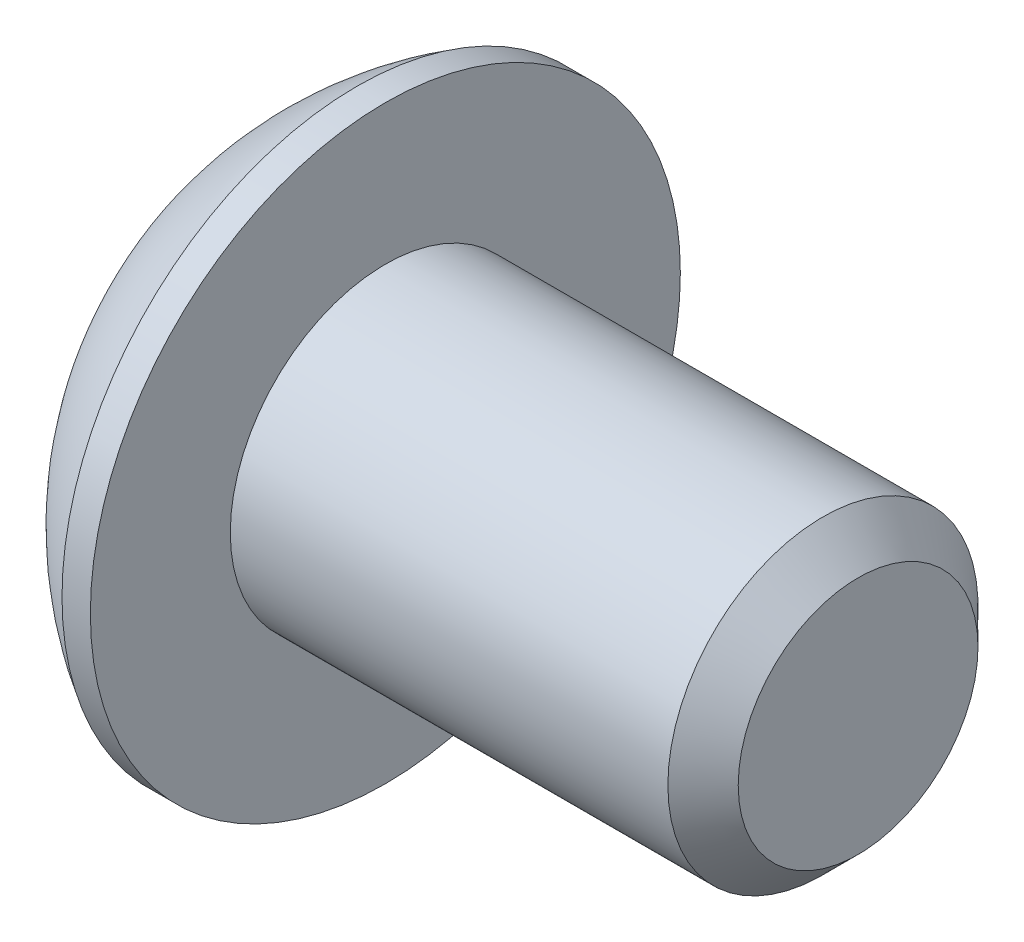
ISO-10303-21;
HEADER;
FILE_DESCRIPTION(('STEP AP214'),'2;1');
FILE_NAME('part.step','',(''),(''),'','','');
FILE_SCHEMA(('AUTOMOTIVE_DESIGN { 1 0 10303 214 1 1 1 1 }'));
ENDSEC;
DATA;
#1=APPLICATION_CONTEXT('core data for automotive mechanical design processes');
#2=APPLICATION_PROTOCOL_DEFINITION('international standard','automotive_design',2000,#1);
#3=PRODUCT_CONTEXT('',#1,'mechanical');
#4=PRODUCT('Part','Part','',(#3));
#5=PRODUCT_RELATED_PRODUCT_CATEGORY('part','',(#4));
#6=PRODUCT_DEFINITION_FORMATION('','',#4);
#7=PRODUCT_DEFINITION_CONTEXT('part definition',#1,'design');
#8=PRODUCT_DEFINITION('design','',#6,#7);
#9=PRODUCT_DEFINITION_SHAPE('','',#8);
#10=(LENGTH_UNIT() NAMED_UNIT(*) SI_UNIT(.MILLI.,.METRE.));
#11=(NAMED_UNIT(*) PLANE_ANGLE_UNIT() SI_UNIT($,.RADIAN.));
#12=(NAMED_UNIT(*) SI_UNIT($,.STERADIAN.) SOLID_ANGLE_UNIT());
#13=UNCERTAINTY_MEASURE_WITH_UNIT(LENGTH_MEASURE(1.E-05),#10,'distance_accuracy_value','');
#14=(GEOMETRIC_REPRESENTATION_CONTEXT(3) GLOBAL_UNCERTAINTY_ASSIGNED_CONTEXT((#13)) GLOBAL_UNIT_ASSIGNED_CONTEXT((#10,
#11,#12)) REPRESENTATION_CONTEXT('',''));
#15=CARTESIAN_POINT('',(0.,0.,0.));
#16=DIRECTION('',(0.,0.,1.));
#17=DIRECTION('',(1.,0.,0.));
#18=AXIS2_PLACEMENT_3D('',#15,#16,#17);
#19=CARTESIAN_POINT('',(8.55980000000001,0.,0.));
#20=DIRECTION('',(-1.,0.,0.));
#21=DIRECTION('',(0.,0.,1.));
#22=AXIS2_PLACEMENT_3D('',#19,#20,#21);
#23=PLANE('',#22);
#24=CARTESIAN_POINT('',(8.55979999994361,0.,0.));
#25=DIRECTION('',(-1.,0.,0.));
#26=DIRECTION('',(0.,0.,1.));
#27=AXIS2_PLACEMENT_3D('',#24,#25,#26);
#28=CIRCLE('',#27,1.61036000008604);
#29=CARTESIAN_POINT('',(8.55979999994361,0.,1.61036000008608));
#30=VERTEX_POINT('',#29);
#31=EDGE_CURVE('E21',#30,#30,#28,.T.);
#32=ORIENTED_EDGE('',*,*,#31,.F.);
#33=EDGE_LOOP('',(#32));
#34=FACE_BOUND('',#33,.T.);
#35=ADVANCED_FACE('F17',(#34),#23,.F.);
#36=CARTESIAN_POINT('',(8.08735999999044,0.,0.));
#37=DIRECTION('',(-1.,0.,0.));
#38=DIRECTION('',(0.,0.,1.));
#39=AXIS2_PLACEMENT_3D('',#36,#37,#38);
#40=CONICAL_SURFACE('',#39,2.08280000003921,0.785398163397448);
#41=ORIENTED_EDGE('',*,*,#31,.T.);
#42=EDGE_LOOP('',(#41));
#43=FACE_BOUND('',#42,.T.);
#44=CARTESIAN_POINT('',(8.08735999999999,0.,0.));
#45=DIRECTION('',(-1.,0.,0.));
#46=DIRECTION('',(0.,0.,1.));
#47=AXIS2_PLACEMENT_3D('',#44,#45,#46);
#48=CIRCLE('',#47,2.08280000000002);
#49=CARTESIAN_POINT('',(8.08735999999999,0.,2.08280000000002));
#50=VERTEX_POINT('',#49);
#51=EDGE_CURVE('E109',#50,#50,#48,.T.);
#52=ORIENTED_EDGE('',*,*,#51,.F.);
#53=EDGE_LOOP('',(#52));
#54=FACE_BOUND('',#53,.T.);
#55=ADVANCED_FACE('F311',(#43,#54),#40,.T.);
#56=CARTESIAN_POINT('',(1.32079999991674,0.,0.));
#57=DIRECTION('',(-1.,0.,0.));
#58=DIRECTION('',(0.,0.,1.));
#59=AXIS2_PLACEMENT_3D('',#56,#57,#58);
#60=CONICAL_SURFACE('',#59,1.19380000000998,1.04719755121067);
#61=CARTESIAN_POINT('',(2.01004075125866,0.,0.));
#62=VERTEX_POINT('',#61);
#63=VERTEX_LOOP('',#62);
#64=FACE_BOUND('',#63,.T.);
#65=CARTESIAN_POINT('',(1.32079999991674,0.,0.));
#66=DIRECTION('',(-1.,0.,0.));
#67=DIRECTION('',(0.,0.,1.));
#68=AXIS2_PLACEMENT_3D('',#65,#66,#67);
#69=CIRCLE('',#68,1.19380000000998);
#70=CARTESIAN_POINT('',(1.32079999995841,-1.03386112704217,0.596900000002525));
#71=VERTEX_POINT('',#70);
#72=CARTESIAN_POINT('',(1.32079999995191,0.,1.19379999997911));
#73=VERTEX_POINT('',#72);
#74=EDGE_CURVE('E94',#71,#73,#69,.T.);
#75=ORIENTED_EDGE('',*,*,#74,.T.);
#76=CARTESIAN_POINT('',(1.32079999991674,0.,0.));
#77=DIRECTION('',(-1.,0.,0.));
#78=DIRECTION('',(0.,0.,1.));
#79=AXIS2_PLACEMENT_3D('',#76,#77,#78);
#80=CIRCLE('',#79,1.19380000000998);
#81=CARTESIAN_POINT('',(1.32079999995841,1.03386112704219,0.596900000002536));
#82=VERTEX_POINT('',#81);
#83=EDGE_CURVE('E88',#73,#82,#80,.T.);
#84=ORIENTED_EDGE('',*,*,#83,.T.);
#85=CARTESIAN_POINT('',(1.32079999991674,0.,0.));
#86=DIRECTION('',(-1.,0.,0.));
#87=DIRECTION('',(0.,0.,1.));
#88=AXIS2_PLACEMENT_3D('',#85,#86,#87);
#89=CIRCLE('',#88,1.19380000000998);
#90=CARTESIAN_POINT('',(1.3207999999586,1.03386112704219,-0.596900000002484));
#91=VERTEX_POINT('',#90);
#92=EDGE_CURVE('E91',#82,#91,#89,.T.);
#93=ORIENTED_EDGE('',*,*,#92,.T.);
#94=CARTESIAN_POINT('',(1.32079999991674,0.,0.));
#95=DIRECTION('',(-1.,0.,0.));
#96=DIRECTION('',(0.,0.,1.));
#97=AXIS2_PLACEMENT_3D('',#94,#95,#96);
#98=CIRCLE('',#97,1.19380000000998);
#99=CARTESIAN_POINT('',(1.32079999995838,1.49000099134676E-12,-1.19380000000498));
#100=VERTEX_POINT('',#99);
#101=EDGE_CURVE('E153',#91,#100,#98,.T.);
#102=ORIENTED_EDGE('',*,*,#101,.T.);
#103=CARTESIAN_POINT('',(1.32079999991674,0.,0.));
#104=DIRECTION('',(-1.,0.,0.));
#105=DIRECTION('',(0.,0.,1.));
#106=AXIS2_PLACEMENT_3D('',#103,#104,#105);
#107=CIRCLE('',#106,1.19380000000998);
#108=CARTESIAN_POINT('',(1.3207999999586,-1.03386112704217,-0.596900000002466));
#109=VERTEX_POINT('',#108);
#110=EDGE_CURVE('E155',#100,#109,#107,.T.);
#111=ORIENTED_EDGE('',*,*,#110,.T.);
#112=CARTESIAN_POINT('',(1.32079999991674,0.,0.));
#113=DIRECTION('',(-1.,0.,0.));
#114=DIRECTION('',(0.,0.,1.));
#115=AXIS2_PLACEMENT_3D('',#112,#113,#114);
#116=CIRCLE('',#115,1.19380000000998);
#117=EDGE_CURVE('E157',#109,#71,#116,.T.);
#118=ORIENTED_EDGE('',*,*,#117,.T.);
#119=EDGE_LOOP('',(#75,#84,#93,#102,#111,#118));
#120=FACE_BOUND('',#119,.T.);
#121=ADVANCED_FACE('F90',(#64,#120),#60,.F.);
#122=CARTESIAN_POINT('',(0.,0.,0.));
#123=DIRECTION('',(-1.,0.,0.));
#124=DIRECTION('',(0.,0.,1.));
#125=AXIS2_PLACEMENT_3D('',#122,#123,#124);
#126=CYLINDRICAL_SURFACE('',#125,2.08280000000002);
#127=ORIENTED_EDGE('',*,*,#51,.T.);
#128=EDGE_LOOP('',(#127));
#129=FACE_BOUND('',#128,.T.);
#130=CARTESIAN_POINT('',(2.20979999999998,0.,0.));
#131=DIRECTION('',(-1.,0.,0.));
#132=DIRECTION('',(0.,0.,1.));
#133=AXIS2_PLACEMENT_3D('',#130,#131,#132);
#134=CIRCLE('',#133,2.08280000000002);
#135=CARTESIAN_POINT('',(2.20979999999998,0.,2.08280000000002));
#136=VERTEX_POINT('',#135);
#137=EDGE_CURVE('E150',#136,#136,#134,.F.);
#138=ORIENTED_EDGE('',*,*,#137,.T.);
#139=EDGE_LOOP('',(#138));
#140=FACE_BOUND('',#139,.T.);
#141=ADVANCED_FACE('F302',(#129,#140),#126,.T.);
#142=CARTESIAN_POINT('',(1.32080000000001,-2.06772225407572,-1.19379999999998));
#143=DIRECTION('',(1.,0.,0.));
#144=DIRECTION('',(0.,0.,-1.));
#145=AXIS2_PLACEMENT_3D('',#142,#143,#144);
#146=PLANE('',#145);
#147=DIRECTION('',(0.,-0.5,-0.866025403784439));
#148=VECTOR('',#147,1.);
#149=CARTESIAN_POINT('',(1.32080000000045,1.37848150271718,0.));
#150=LINE('',#149,#148);
#151=CARTESIAN_POINT('',(1.32080000000016,1.37848150271718,0.));
#152=VERTEX_POINT('',#151);
#153=EDGE_CURVE('E107',#91,#152,#150,.F.);
#154=ORIENTED_EDGE('',*,*,#153,.F.);
#155=ORIENTED_EDGE('',*,*,#92,.F.);
#156=DIRECTION('',(0.,0.5,-0.866025403784438));
#157=VECTOR('',#156,1.);
#158=CARTESIAN_POINT('',(1.32080000000001,0.68924075135858,1.19380000000002));
#159=LINE('',#158,#157);
#160=EDGE_CURVE('E105',#152,#82,#159,.F.);
#161=ORIENTED_EDGE('',*,*,#160,.F.);
#162=EDGE_LOOP('',(#154,#155,#161));
#163=FACE_BOUND('',#162,.T.);
#164=ADVANCED_FACE('F103',(#163),#146,.F.);
#165=CARTESIAN_POINT('',(1.32080000000001,-2.06772225407572,-1.19379999999998));
#166=DIRECTION('',(1.,0.,0.));
#167=DIRECTION('',(0.,0.,-1.));
#168=AXIS2_PLACEMENT_3D('',#165,#166,#167);
#169=PLANE('',#168);
#170=DIRECTION('',(0.,0.5,-0.866025403784438));
#171=VECTOR('',#170,1.);
#172=CARTESIAN_POINT('',(1.32080000000007,0.68924075135858,1.19380000000002));
#173=LINE('',#172,#171);
#174=CARTESIAN_POINT('',(1.32080000000028,0.6892407513586,1.19380000000003));
#175=VERTEX_POINT('',#174);
#176=EDGE_CURVE('E110',#82,#175,#173,.F.);
#177=ORIENTED_EDGE('',*,*,#176,.F.);
#178=ORIENTED_EDGE('',*,*,#83,.F.);
#179=DIRECTION('',(0.,1.,0.));
#180=VECTOR('',#179,1.);
#181=CARTESIAN_POINT('',(1.32080000000051,-0.689240751358577,1.19380000000003));
#182=LINE('',#181,#180);
#183=EDGE_CURVE('E113',#175,#73,#182,.F.);
#184=ORIENTED_EDGE('',*,*,#183,.F.);
#185=EDGE_LOOP('',(#177,#178,#184));
#186=FACE_BOUND('',#185,.T.);
#187=ADVANCED_FACE('F111',(#186),#169,.F.);
#188=CARTESIAN_POINT('',(1.32080000000001,-2.06772225407572,-1.19379999999998));
#189=DIRECTION('',(1.,0.,0.));
#190=DIRECTION('',(0.,0.,-1.));
#191=AXIS2_PLACEMENT_3D('',#188,#189,#190);
#192=PLANE('',#191);
#193=DIRECTION('',(0.,1.,0.));
#194=VECTOR('',#193,1.);
#195=CARTESIAN_POINT('',(1.32080000000057,-0.689240751358577,1.19380000000003));
#196=LINE('',#195,#194);
#197=CARTESIAN_POINT('',(1.32080000000045,-0.689240751358574,1.19380000000003));
#198=VERTEX_POINT('',#197);
#199=EDGE_CURVE('E171',#73,#198,#196,.F.);
#200=ORIENTED_EDGE('',*,*,#199,.F.);
#201=ORIENTED_EDGE('',*,*,#74,.F.);
#202=DIRECTION('',(0.,0.5,0.866025403784439));
#203=VECTOR('',#202,1.);
#204=CARTESIAN_POINT('',(1.32080000000051,-1.37848150271714,0.));
#205=LINE('',#204,#203);
#206=EDGE_CURVE('E169',#198,#71,#205,.F.);
#207=ORIENTED_EDGE('',*,*,#206,.F.);
#208=EDGE_LOOP('',(#200,#201,#207));
#209=FACE_BOUND('',#208,.T.);
#210=ADVANCED_FACE('F167',(#209),#192,.F.);
#211=CARTESIAN_POINT('',(1.32080000000001,-2.06772225407572,-1.19379999999998));
#212=DIRECTION('',(1.,0.,0.));
#213=DIRECTION('',(0.,0.,-1.));
#214=AXIS2_PLACEMENT_3D('',#211,#212,#213);
#215=PLANE('',#214);
#216=DIRECTION('',(0.,0.5,0.866025403784439));
#217=VECTOR('',#216,1.);
#218=CARTESIAN_POINT('',(1.32080000000007,-1.37848150271714,0.));
#219=LINE('',#218,#217);
#220=CARTESIAN_POINT('',(1.32080000000003,-1.37848150271713,0.));
#221=VERTEX_POINT('',#220);
#222=EDGE_CURVE('E172',#71,#221,#219,.F.);
#223=ORIENTED_EDGE('',*,*,#222,.F.);
#224=ORIENTED_EDGE('',*,*,#117,.F.);
#225=DIRECTION('',(0.,-0.5,0.866025403784439));
#226=VECTOR('',#225,1.);
#227=CARTESIAN_POINT('',(1.32080000000001,-0.689240751358577,-1.19379999999997));
#228=LINE('',#227,#226);
#229=EDGE_CURVE('E175',#221,#109,#228,.F.);
#230=ORIENTED_EDGE('',*,*,#229,.F.);
#231=EDGE_LOOP('',(#223,#224,#230));
#232=FACE_BOUND('',#231,.T.);
#233=ADVANCED_FACE('F173',(#232),#215,.F.);
#234=CARTESIAN_POINT('',(1.32080000000001,-2.06772225407572,-1.19379999999998));
#235=DIRECTION('',(1.,0.,0.));
#236=DIRECTION('',(0.,0.,-1.));
#237=AXIS2_PLACEMENT_3D('',#234,#235,#236);
#238=PLANE('',#237);
#239=DIRECTION('',(0.,-0.5,0.866025403784439));
#240=VECTOR('',#239,1.);
#241=CARTESIAN_POINT('',(1.32080000000045,-0.689240751358577,-1.19379999999997));
#242=LINE('',#241,#240);
#243=CARTESIAN_POINT('',(1.32080000000016,-0.689240751358563,-1.19379999999999));
#244=VERTEX_POINT('',#243);
#245=EDGE_CURVE('E230',#109,#244,#242,.F.);
#246=ORIENTED_EDGE('',*,*,#245,.F.);
#247=ORIENTED_EDGE('',*,*,#110,.F.);
#248=DIRECTION('',(0.,1.,0.));
#249=VECTOR('',#248,1.);
#250=CARTESIAN_POINT('',(1.32080000000001,0.689240751358615,-1.19380000000001));
#251=LINE('',#250,#249);
#252=EDGE_CURVE('E242',#244,#100,#251,.T.);
#253=ORIENTED_EDGE('',*,*,#252,.F.);
#254=EDGE_LOOP('',(#246,#247,#253));
#255=FACE_BOUND('',#254,.T.);
#256=ADVANCED_FACE('F263',(#255),#238,.F.);
#257=CARTESIAN_POINT('',(1.32080000000001,-2.06772225407572,-1.19379999999998));
#258=DIRECTION('',(1.,0.,0.));
#259=DIRECTION('',(0.,0.,-1.));
#260=AXIS2_PLACEMENT_3D('',#257,#258,#259);
#261=PLANE('',#260);
#262=DIRECTION('',(0.,1.,0.));
#263=VECTOR('',#262,1.);
#264=CARTESIAN_POINT('',(1.32080000000001,0.689240751358615,-1.19380000000001));
#265=LINE('',#264,#263);
#266=CARTESIAN_POINT('',(1.32080000000001,0.689240751358576,-1.19380000000002));
#267=VERTEX_POINT('',#266);
#268=EDGE_CURVE('E250',#100,#267,#265,.T.);
#269=ORIENTED_EDGE('',*,*,#268,.F.);
#270=ORIENTED_EDGE('',*,*,#101,.F.);
#271=DIRECTION('',(0.,-0.5,-0.866025403784439));
#272=VECTOR('',#271,1.);
#273=CARTESIAN_POINT('',(1.32080000000001,1.37848150271718,0.));
#274=LINE('',#273,#272);
#275=EDGE_CURVE('E132',#267,#91,#274,.F.);
#276=ORIENTED_EDGE('',*,*,#275,.F.);
#277=EDGE_LOOP('',(#269,#270,#276));
#278=FACE_BOUND('',#277,.T.);
#279=ADVANCED_FACE('F265',(#278),#261,.F.);
#280=CARTESIAN_POINT('',(2.20979999999998,2.08280000000001,0.));
#281=DIRECTION('',(-1.,0.,0.));
#282=DIRECTION('',(0.,0.,1.));
#283=AXIS2_PLACEMENT_3D('',#280,#281,#282);
#284=PLANE('',#283);
#285=CARTESIAN_POINT('',(2.20979999999998,0.,0.));
#286=DIRECTION('',(-1.,0.,0.));
#287=DIRECTION('',(0.,0.,1.));
#288=AXIS2_PLACEMENT_3D('',#285,#286,#287);
#289=CIRCLE('',#288,3.96240000000004);
#290=CARTESIAN_POINT('',(2.20979999999998,0.,3.96240000000004));
#291=VERTEX_POINT('',#290);
#292=EDGE_CURVE('E139',#291,#291,#289,.T.);
#293=ORIENTED_EDGE('',*,*,#292,.F.);
#294=EDGE_LOOP('',(#293));
#295=FACE_BOUND('',#294,.T.);
#296=ORIENTED_EDGE('',*,*,#137,.F.);
#297=EDGE_LOOP('',(#296));
#298=FACE_BOUND('',#297,.T.);
#299=ADVANCED_FACE('F296',(#295,#298),#284,.F.);
#300=CARTESIAN_POINT('',(1.32080000000001,1.37848150271718,0.));
#301=DIRECTION('',(0.,-0.866025403784439,0.5));
#302=DIRECTION('',(0.,-0.5,-0.866025403784439));
#303=AXIS2_PLACEMENT_3D('',#300,#301,#302);
#304=PLANE('',#303);
#305=ORIENTED_EDGE('',*,*,#153,.T.);
#306=DIRECTION('',(1.,0.,0.));
#307=VECTOR('',#306,1.);
#308=CARTESIAN_POINT('',(1.32080000000051,1.37848150271717,0.));
#309=LINE('',#308,#307);
#310=CARTESIAN_POINT('',(0.,1.37848150271718,0.));
#311=VERTEX_POINT('',#310);
#312=EDGE_CURVE('E120',#311,#152,#309,.T.);
#313=ORIENTED_EDGE('',*,*,#312,.F.);
#314=DIRECTION('',(0.,0.499999999999998,0.86602540378444));
#315=VECTOR('',#314,1.);
#316=CARTESIAN_POINT('',(0.,0.689240751358606,-1.19380000000002));
#317=LINE('',#316,#315);
#318=CARTESIAN_POINT('',(0.,0.689240751358589,-1.19380000000001));
#319=VERTEX_POINT('',#318);
#320=EDGE_CURVE('E135',#319,#311,#317,.T.);
#321=ORIENTED_EDGE('',*,*,#320,.F.);
#322=DIRECTION('',(1.,0.,0.));
#323=VECTOR('',#322,1.);
#324=CARTESIAN_POINT('',(1.32080000000001,0.689240751358594,-1.19380000000001));
#325=LINE('',#324,#323);
#326=EDGE_CURVE('E149',#267,#319,#325,.F.);
#327=ORIENTED_EDGE('',*,*,#326,.F.);
#328=ORIENTED_EDGE('',*,*,#275,.T.);
#329=EDGE_LOOP('',(#305,#313,#321,#327,#328));
#330=FACE_BOUND('',#329,.T.);
#331=ADVANCED_FACE('F268',(#330),#304,.T.);
#332=CARTESIAN_POINT('',(1.32080000000051,0.68924075135858,1.19380000000002));
#333=DIRECTION('',(0.,-0.866025403784438,-0.5));
#334=DIRECTION('',(0.,0.5,-0.866025403784438));
#335=AXIS2_PLACEMENT_3D('',#332,#333,#334);
#336=PLANE('',#335);
#337=ORIENTED_EDGE('',*,*,#176,.T.);
#338=DIRECTION('',(1.,0.,0.));
#339=VECTOR('',#338,1.);
#340=CARTESIAN_POINT('',(1.32080000000051,0.68924075135861,1.19380000000003));
#341=LINE('',#340,#339);
#342=CARTESIAN_POINT('',(1.87350135405495E-13,0.689240751358602,1.19380000000002));
#343=VERTEX_POINT('',#342);
#344=EDGE_CURVE('E116',#343,#175,#341,.T.);
#345=ORIENTED_EDGE('',*,*,#344,.F.);
#346=DIRECTION('',(0.,-0.5,0.866025403784439));
#347=VECTOR('',#346,1.);
#348=CARTESIAN_POINT('',(0.,1.37848150271719,0.));
#349=LINE('',#348,#347);
#350=EDGE_CURVE('E138',#311,#343,#349,.T.);
#351=ORIENTED_EDGE('',*,*,#350,.F.);
#352=ORIENTED_EDGE('',*,*,#312,.T.);
#353=ORIENTED_EDGE('',*,*,#160,.T.);
#354=EDGE_LOOP('',(#337,#345,#351,#352,#353));
#355=FACE_BOUND('',#354,.T.);
#356=ADVANCED_FACE('F118',(#355),#336,.T.);
#357=CARTESIAN_POINT('',(1.32080000000051,-0.689240751358577,1.19380000000003));
#358=DIRECTION('',(0.,0.,-1.));
#359=DIRECTION('',(0.,1.,0.));
#360=AXIS2_PLACEMENT_3D('',#357,#358,#359);
#361=PLANE('',#360);
#362=ORIENTED_EDGE('',*,*,#199,.T.);
#363=DIRECTION('',(1.,0.,0.));
#364=VECTOR('',#363,1.);
#365=CARTESIAN_POINT('',(1.32080000000001,-0.689240751358573,1.19380000000003));
#366=LINE('',#365,#364);
#367=CARTESIAN_POINT('',(1.2490009027033E-13,-0.689240751358571,1.19380000000003));
#368=VERTEX_POINT('',#367);
#369=EDGE_CURVE('E182',#368,#198,#366,.T.);
#370=ORIENTED_EDGE('',*,*,#369,.F.);
#371=DIRECTION('',(0.,1.,0.));
#372=VECTOR('',#371,1.);
#373=CARTESIAN_POINT('',(0.,0.,1.19380000000001));
#374=LINE('',#373,#372);
#375=EDGE_CURVE('E196',#343,#368,#374,.F.);
#376=ORIENTED_EDGE('',*,*,#375,.F.);
#377=ORIENTED_EDGE('',*,*,#344,.T.);
#378=ORIENTED_EDGE('',*,*,#183,.T.);
#379=EDGE_LOOP('',(#362,#370,#376,#377,#378));
#380=FACE_BOUND('',#379,.T.);
#381=ADVANCED_FACE('F218',(#380),#361,.T.);
#382=CARTESIAN_POINT('',(1.32080000000001,-1.37848150271714,0.));
#383=DIRECTION('',(0.,0.866025403784439,-0.5));
#384=DIRECTION('',(0.,0.5,0.866025403784439));
#385=AXIS2_PLACEMENT_3D('',#382,#383,#384);
#386=PLANE('',#385);
#387=ORIENTED_EDGE('',*,*,#222,.T.);
#388=DIRECTION('',(1.,0.,0.));
#389=VECTOR('',#388,1.);
#390=CARTESIAN_POINT('',(1.32080000000001,-1.37848150271713,0.));
#391=LINE('',#390,#389);
#392=CARTESIAN_POINT('',(0.,-1.37848150271714,0.));
#393=VERTEX_POINT('',#392);
#394=EDGE_CURVE('E178',#393,#221,#391,.T.);
#395=ORIENTED_EDGE('',*,*,#394,.F.);
#396=DIRECTION('',(0.,-0.499999999999989,-0.866025403784445));
#397=VECTOR('',#396,1.);
#398=CARTESIAN_POINT('',(0.,-0.689240751358566,1.19380000000003));
#399=LINE('',#398,#397);
#400=EDGE_CURVE('E199',#368,#393,#399,.T.);
#401=ORIENTED_EDGE('',*,*,#400,.F.);
#402=ORIENTED_EDGE('',*,*,#369,.T.);
#403=ORIENTED_EDGE('',*,*,#206,.T.);
#404=EDGE_LOOP('',(#387,#395,#401,#402,#403));
#405=FACE_BOUND('',#404,.T.);
#406=ADVANCED_FACE('F180',(#405),#386,.T.);
#407=CARTESIAN_POINT('',(1.32080000000001,-0.689240751358577,-1.19379999999997));
#408=DIRECTION('',(0.,0.866025403784439,0.5));
#409=DIRECTION('',(0.,-0.5,0.866025403784439));
#410=AXIS2_PLACEMENT_3D('',#407,#408,#409);
#411=PLANE('',#410);
#412=ORIENTED_EDGE('',*,*,#245,.T.);
#413=DIRECTION('',(1.,0.,0.));
#414=VECTOR('',#413,1.);
#415=CARTESIAN_POINT('',(1.32080000000001,-0.689240751358556,-1.19380000000001));
#416=LINE('',#415,#414);
#417=CARTESIAN_POINT('',(0.,-0.689240751358556,-1.19380000000001));
#418=VERTEX_POINT('',#417);
#419=EDGE_CURVE('E36',#418,#244,#416,.T.);
#420=ORIENTED_EDGE('',*,*,#419,.F.);
#421=DIRECTION('',(0.,0.50000000000001,-0.866025403784433));
#422=VECTOR('',#421,1.);
#423=CARTESIAN_POINT('',(0.,-1.37848150271715,0.));
#424=LINE('',#423,#422);
#425=EDGE_CURVE('E219',#393,#418,#424,.T.);
#426=ORIENTED_EDGE('',*,*,#425,.F.);
#427=ORIENTED_EDGE('',*,*,#394,.T.);
#428=ORIENTED_EDGE('',*,*,#229,.T.);
#429=EDGE_LOOP('',(#412,#420,#426,#427,#428));
#430=FACE_BOUND('',#429,.T.);
#431=ADVANCED_FACE('F269',(#430),#411,.T.);
#432=CARTESIAN_POINT('',(1.32080000000001,0.689240751358615,-1.19380000000001));
#433=DIRECTION('',(0.,0.,1.));
#434=DIRECTION('',(1.,0.,0.));
#435=AXIS2_PLACEMENT_3D('',#432,#433,#434);
#436=PLANE('',#435);
#437=ORIENTED_EDGE('',*,*,#268,.T.);
#438=ORIENTED_EDGE('',*,*,#326,.T.);
#439=DIRECTION('',(0.,1.,0.));
#440=VECTOR('',#439,1.);
#441=CARTESIAN_POINT('',(0.,0.,-1.19380000000001));
#442=LINE('',#441,#440);
#443=EDGE_CURVE('E146',#418,#319,#442,.T.);
#444=ORIENTED_EDGE('',*,*,#443,.F.);
#445=ORIENTED_EDGE('',*,*,#419,.T.);
#446=ORIENTED_EDGE('',*,*,#252,.T.);
#447=EDGE_LOOP('',(#437,#438,#444,#445,#446));
#448=FACE_BOUND('',#447,.T.);
#449=ADVANCED_FACE('F260',(#448),#436,.T.);
#450=CARTESIAN_POINT('',(0.,0.,0.));
#451=DIRECTION('',(-1.,0.,0.));
#452=DIRECTION('',(0.,0.,1.));
#453=AXIS2_PLACEMENT_3D('',#450,#451,#452);
#454=CYLINDRICAL_SURFACE('',#453,3.96240000000004);
#455=CARTESIAN_POINT('',(1.82880000000002,0.,0.));
#456=DIRECTION('',(-1.,0.,0.));
#457=DIRECTION('',(0.,0.,1.));
#458=AXIS2_PLACEMENT_3D('',#455,#456,#457);
#459=CIRCLE('',#458,3.96240000000004);
#460=CARTESIAN_POINT('',(1.82880000000002,0.,3.96240000000004));
#461=VERTEX_POINT('',#460);
#462=EDGE_CURVE('E27',#461,#461,#459,.T.);
#463=ORIENTED_EDGE('',*,*,#462,.F.);
#464=EDGE_LOOP('',(#463));
#465=FACE_BOUND('',#464,.T.);
#466=ORIENTED_EDGE('',*,*,#292,.T.);
#467=EDGE_LOOP('',(#466));
#468=FACE_BOUND('',#467,.T.);
#469=ADVANCED_FACE('F277',(#465,#468),#454,.T.);
#470=CARTESIAN_POINT('',(0.,0.,0.));
#471=DIRECTION('',(-1.,0.,0.));
#472=DIRECTION('',(0.,0.,1.));
#473=AXIS2_PLACEMENT_3D('',#470,#471,#472);
#474=PLANE('',#473);
#475=CARTESIAN_POINT('',(0.,0.,0.));
#476=DIRECTION('',(-1.,0.,0.));
#477=DIRECTION('',(0.,0.,1.));
#478=AXIS2_PLACEMENT_3D('',#475,#476,#477);
#479=CIRCLE('',#478,1.98120000000045);
#480=CARTESIAN_POINT('',(0.,0.,1.98120000000042));
#481=VERTEX_POINT('',#480);
#482=EDGE_CURVE('E11',#481,#481,#479,.F.);
#483=ORIENTED_EDGE('',*,*,#482,.F.);
#484=EDGE_LOOP('',(#483));
#485=FACE_BOUND('',#484,.T.);
#486=ORIENTED_EDGE('',*,*,#425,.T.);
#487=ORIENTED_EDGE('',*,*,#443,.T.);
#488=ORIENTED_EDGE('',*,*,#320,.T.);
#489=ORIENTED_EDGE('',*,*,#350,.T.);
#490=ORIENTED_EDGE('',*,*,#375,.T.);
#491=ORIENTED_EDGE('',*,*,#400,.T.);
#492=EDGE_LOOP('',(#486,#487,#488,#489,#490,#491));
#493=FACE_BOUND('',#492,.T.);
#494=ADVANCED_FACE('F212',(#485,#493),#474,.T.);
#495=CARTESIAN_POINT('',(4.13384999999996,0.,0.));
#496=DIRECTION('',(0.,1.,0.));
#497=DIRECTION('',(-0.489667403954923,0.,-0.8719093034852));
#498=AXIS2_PLACEMENT_3D('',#495,#496,#497);
#499=SPHERICAL_SURFACE('',#498,4.58408870578455);
#500=CARTESIAN_POINT('',(4.13384999999996,0.,0.));
#501=DIRECTION('',(-1.,0.,0.));
#502=DIRECTION('',(0.,0.,1.));
#503=AXIS2_PLACEMENT_3D('',#500,#501,#502);
#504=SPHERICAL_SURFACE('',#503,4.58408870578455);
#505=ORIENTED_EDGE('',*,*,#482,.T.);
#506=EDGE_LOOP('',(#505));
#507=FACE_BOUND('',#506,.T.);
#508=ORIENTED_EDGE('',*,*,#462,.T.);
#509=EDGE_LOOP('',(#508));
#510=FACE_BOUND('',#509,.T.);
#511=ADVANCED_FACE('F19',(#507,#510),#504,.T.);
#512=CLOSED_SHELL('',(#35,#55,#121,#141,#164,#187,#210,#233,#256,#279,#299,#331,#356,#381,#406,
#431,#449,#469,#494,#511));
#513=MANIFOLD_SOLID_BREP('B1',#512);
#514=ADVANCED_BREP_SHAPE_REPRESENTATION('',(#18,#513),#14);
#515=SHAPE_DEFINITION_REPRESENTATION(#9,#514);
ENDSEC;
END-ISO-10303-21;
